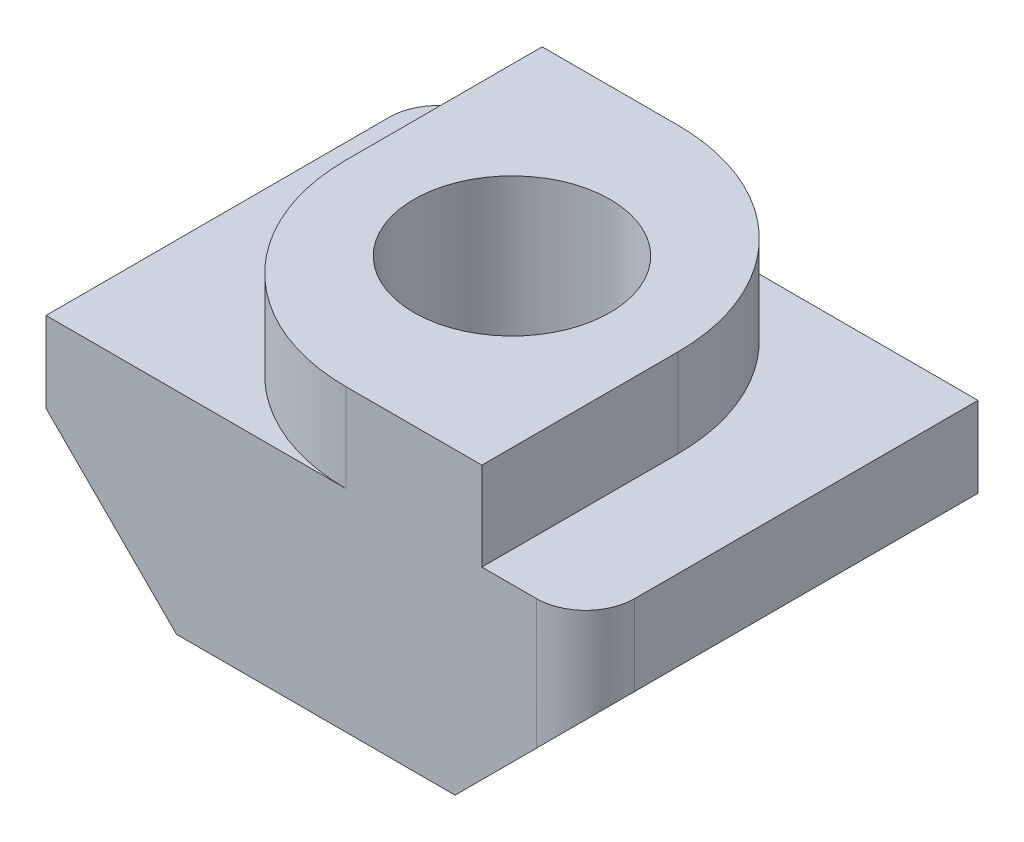
ISO-10303-21;
HEADER;
FILE_DESCRIPTION(('STEP AP214'),'2;1');
FILE_NAME('part.step','',(''),(''),'','','');
FILE_SCHEMA(('AUTOMOTIVE_DESIGN { 1 0 10303 214 1 1 1 1 }'));
ENDSEC;
DATA;
#1=APPLICATION_CONTEXT('core data for automotive mechanical design processes');
#2=APPLICATION_PROTOCOL_DEFINITION('international standard','automotive_design',2000,#1);
#3=PRODUCT_CONTEXT('',#1,'mechanical');
#4=PRODUCT('Part','Part','',(#3));
#5=PRODUCT_RELATED_PRODUCT_CATEGORY('part','',(#4));
#6=PRODUCT_DEFINITION_FORMATION('','',#4);
#7=PRODUCT_DEFINITION_CONTEXT('part definition',#1,'design');
#8=PRODUCT_DEFINITION('design','',#6,#7);
#9=PRODUCT_DEFINITION_SHAPE('','',#8);
#10=(LENGTH_UNIT() NAMED_UNIT(*) SI_UNIT(.MILLI.,.METRE.));
#11=(NAMED_UNIT(*) PLANE_ANGLE_UNIT() SI_UNIT($,.RADIAN.));
#12=(NAMED_UNIT(*) SI_UNIT($,.STERADIAN.) SOLID_ANGLE_UNIT());
#13=UNCERTAINTY_MEASURE_WITH_UNIT(LENGTH_MEASURE(1.E-05),#10,'distance_accuracy_value','');
#14=(GEOMETRIC_REPRESENTATION_CONTEXT(3) GLOBAL_UNCERTAINTY_ASSIGNED_CONTEXT((#13)) GLOBAL_UNIT_ASSIGNED_CONTEXT((#10,
#11,#12)) REPRESENTATION_CONTEXT('',''));
#15=CARTESIAN_POINT('',(0.,0.,0.));
#16=DIRECTION('',(0.,0.,1.));
#17=DIRECTION('',(1.,0.,0.));
#18=AXIS2_PLACEMENT_3D('',#15,#16,#17);
#19=CARTESIAN_POINT('',(0.,4.3,0.));
#20=DIRECTION('',(0.,-1.,0.));
#21=DIRECTION('',(0.,0.,-1.));
#22=AXIS2_PLACEMENT_3D('',#19,#20,#21);
#23=PLANE('',#22);
#24=DIRECTION('',(1.,0.,0.));
#25=VECTOR('',#24,1.);
#26=CARTESIAN_POINT('',(-5.5,4.3,4.));
#27=LINE('',#26,#25);
#28=CARTESIAN_POINT('',(3.385,4.3,4.));
#29=VERTEX_POINT('',#28);
#30=CARTESIAN_POINT('',(4.5,4.3,4.));
#31=VERTEX_POINT('',#30);
#32=EDGE_CURVE('E256',#29,#31,#27,.T.);
#33=ORIENTED_EDGE('',*,*,#32,.T.);
#34=CARTESIAN_POINT('',(4.5,4.3,3.));
#35=DIRECTION('',(0.,-1.,0.));
#36=DIRECTION('',(0.,0.,-1.));
#37=AXIS2_PLACEMENT_3D('',#34,#35,#36);
#38=CIRCLE('',#37,1.);
#39=CARTESIAN_POINT('',(5.5,4.3,3.));
#40=VERTEX_POINT('',#39);
#41=EDGE_CURVE('E204',#31,#40,#38,.F.);
#42=ORIENTED_EDGE('',*,*,#41,.T.);
#43=DIRECTION('',(0.,0.,-1.));
#44=VECTOR('',#43,1.);
#45=CARTESIAN_POINT('',(5.5,4.3,4.));
#46=LINE('',#45,#44);
#47=CARTESIAN_POINT('',(5.5,4.3,-4.));
#48=VERTEX_POINT('',#47);
#49=EDGE_CURVE('E234',#40,#48,#46,.T.);
#50=ORIENTED_EDGE('',*,*,#49,.T.);
#51=DIRECTION('',(-1.,0.,0.));
#52=VECTOR('',#51,1.);
#53=CARTESIAN_POINT('',(-5.5,4.3,-4.));
#54=LINE('',#53,#52);
#55=CARTESIAN_POINT('',(-0.615,4.3,-4.));
#56=VERTEX_POINT('',#55);
#57=EDGE_CURVE('E244',#48,#56,#54,.T.);
#58=ORIENTED_EDGE('',*,*,#57,.T.);
#59=CARTESIAN_POINT('',(-0.615,4.3,0.));
#60=DIRECTION('',(0.,-1.,0.));
#61=DIRECTION('',(0.,0.,-1.));
#62=AXIS2_PLACEMENT_3D('',#59,#60,#61);
#63=CIRCLE('',#62,4.);
#64=CARTESIAN_POINT('',(3.385,4.3,0.));
#65=VERTEX_POINT('',#64);
#66=EDGE_CURVE('E193',#56,#65,#63,.T.);
#67=ORIENTED_EDGE('',*,*,#66,.T.);
#68=DIRECTION('',(0.,0.,-1.));
#69=VECTOR('',#68,1.);
#70=CARTESIAN_POINT('',(3.385,4.3,4.));
#71=LINE('',#70,#69);
#72=EDGE_CURVE('E170',#29,#65,#71,.T.);
#73=ORIENTED_EDGE('',*,*,#72,.F.);
#74=EDGE_LOOP('',(#33,#42,#50,#58,#67,#73));
#75=FACE_BOUND('',#74,.T.);
#76=ADVANCED_FACE('F33',(#75),#23,.F.);
#77=CARTESIAN_POINT('',(-3.385,4.3,-4.));
#78=VERTEX_POINT('',#77);
#79=CARTESIAN_POINT('',(-4.5,4.3,-4.));
#80=VERTEX_POINT('',#79);
#81=EDGE_CURVE('E151',#78,#80,#54,.T.);
#82=ORIENTED_EDGE('',*,*,#81,.T.);
#83=CARTESIAN_POINT('',(-4.5,4.3,-3.));
#84=DIRECTION('',(0.,-1.,0.));
#85=DIRECTION('',(0.,0.,-1.));
#86=AXIS2_PLACEMENT_3D('',#83,#84,#85);
#87=CIRCLE('',#86,1.);
#88=CARTESIAN_POINT('',(-5.5,4.3,-3.));
#89=VERTEX_POINT('',#88);
#90=EDGE_CURVE('E11',#80,#89,#87,.F.);
#91=ORIENTED_EDGE('',*,*,#90,.T.);
#92=DIRECTION('',(0.,0.,1.));
#93=VECTOR('',#92,1.);
#94=CARTESIAN_POINT('',(-5.5,4.3,4.));
#95=LINE('',#94,#93);
#96=CARTESIAN_POINT('',(-5.5,4.3,4.));
#97=VERTEX_POINT('',#96);
#98=EDGE_CURVE('E216',#89,#97,#95,.T.);
#99=ORIENTED_EDGE('',*,*,#98,.T.);
#100=CARTESIAN_POINT('',(0.615,4.3,4.));
#101=VERTEX_POINT('',#100);
#102=EDGE_CURVE('E250',#97,#101,#27,.T.);
#103=ORIENTED_EDGE('',*,*,#102,.T.);
#104=CARTESIAN_POINT('',(0.615,4.3,0.));
#105=DIRECTION('',(0.,-1.,0.));
#106=DIRECTION('',(0.,0.,-1.));
#107=AXIS2_PLACEMENT_3D('',#104,#105,#106);
#108=CIRCLE('',#107,4.);
#109=CARTESIAN_POINT('',(-3.385,4.3,0.));
#110=VERTEX_POINT('',#109);
#111=EDGE_CURVE('E195',#101,#110,#108,.T.);
#112=ORIENTED_EDGE('',*,*,#111,.T.);
#113=DIRECTION('',(0.,0.,1.));
#114=VECTOR('',#113,1.);
#115=CARTESIAN_POINT('',(-3.385,4.3,4.));
#116=LINE('',#115,#114);
#117=EDGE_CURVE('E174',#78,#110,#116,.T.);
#118=ORIENTED_EDGE('',*,*,#117,.F.);
#119=EDGE_LOOP('',(#82,#91,#99,#103,#112,#118));
#120=FACE_BOUND('',#119,.T.);
#121=ADVANCED_FACE('F265',(#120),#23,.F.);
#122=CARTESIAN_POINT('',(0.,0.,0.));
#123=DIRECTION('',(0.,-1.,0.));
#124=DIRECTION('',(0.,0.,-1.));
#125=AXIS2_PLACEMENT_3D('',#122,#123,#124);
#126=PLANE('',#125);
#127=DIRECTION('',(0.,0.,1.));
#128=VECTOR('',#127,1.);
#129=CARTESIAN_POINT('',(2.84000000000001,0.,-4.));
#130=LINE('',#129,#128);
#131=CARTESIAN_POINT('',(2.84000000000001,0.,-4.));
#132=VERTEX_POINT('',#131);
#133=CARTESIAN_POINT('',(2.84000000000001,0.,4.));
#134=VERTEX_POINT('',#133);
#135=EDGE_CURVE('E342',#132,#134,#130,.T.);
#136=ORIENTED_EDGE('',*,*,#135,.T.);
#137=DIRECTION('',(1.,0.,0.));
#138=VECTOR('',#137,1.);
#139=CARTESIAN_POINT('',(-5.5,0.,4.));
#140=LINE('',#139,#138);
#141=CARTESIAN_POINT('',(-2.84000000000001,0.,4.));
#142=VERTEX_POINT('',#141);
#143=EDGE_CURVE('E236',#142,#134,#140,.T.);
#144=ORIENTED_EDGE('',*,*,#143,.F.);
#145=DIRECTION('',(0.,0.,1.));
#146=VECTOR('',#145,1.);
#147=CARTESIAN_POINT('',(-2.84000000000001,0.,-4.));
#148=LINE('',#147,#146);
#149=CARTESIAN_POINT('',(-2.84000000000001,0.,-4.));
#150=VERTEX_POINT('',#149);
#151=EDGE_CURVE('E224',#150,#142,#148,.T.);
#152=ORIENTED_EDGE('',*,*,#151,.F.);
#153=DIRECTION('',(-1.,0.,0.));
#154=VECTOR('',#153,1.);
#155=CARTESIAN_POINT('',(-5.5,0.,-4.));
#156=LINE('',#155,#154);
#157=EDGE_CURVE('E227',#132,#150,#156,.T.);
#158=ORIENTED_EDGE('',*,*,#157,.F.);
#159=EDGE_LOOP('',(#136,#144,#152,#158));
#160=FACE_BOUND('',#159,.T.);
#161=CARTESIAN_POINT('',(0.,0.,0.));
#162=DIRECTION('',(0.,1.,0.));
#163=DIRECTION('',(0.,0.,1.));
#164=AXIS2_PLACEMENT_3D('',#161,#162,#163);
#165=CIRCLE('',#164,2.);
#166=CARTESIAN_POINT('',(0.,0.,2.));
#167=VERTEX_POINT('',#166);
#168=EDGE_CURVE('E223',#167,#167,#165,.T.);
#169=ORIENTED_EDGE('',*,*,#168,.T.);
#170=EDGE_LOOP('',(#169));
#171=FACE_BOUND('',#170,.T.);
#172=ADVANCED_FACE('F298',(#160,#171),#126,.T.);
#173=CARTESIAN_POINT('',(5.5,4.3,4.));
#174=DIRECTION('',(-1.,0.,0.));
#175=DIRECTION('',(0.,0.,1.));
#176=AXIS2_PLACEMENT_3D('',#173,#174,#175);
#177=PLANE('',#176);
#178=ORIENTED_EDGE('',*,*,#49,.F.);
#179=DIRECTION('',(0.,-1.,0.));
#180=VECTOR('',#179,1.);
#181=CARTESIAN_POINT('',(5.5,4.3,3.));
#182=LINE('',#181,#180);
#183=CARTESIAN_POINT('',(5.5,2.66,3.));
#184=VERTEX_POINT('',#183);
#185=EDGE_CURVE('E197',#40,#184,#182,.T.);
#186=ORIENTED_EDGE('',*,*,#185,.T.);
#187=DIRECTION('',(0.,0.,1.));
#188=VECTOR('',#187,1.);
#189=CARTESIAN_POINT('',(5.5,2.66,-4.));
#190=LINE('',#189,#188);
#191=CARTESIAN_POINT('',(5.5,2.66,-4.));
#192=VERTEX_POINT('',#191);
#193=EDGE_CURVE('E333',#192,#184,#190,.T.);
#194=ORIENTED_EDGE('',*,*,#193,.F.);
#195=DIRECTION('',(0.,-1.,0.));
#196=VECTOR('',#195,1.);
#197=CARTESIAN_POINT('',(5.5,4.3,-4.));
#198=LINE('',#197,#196);
#199=EDGE_CURVE('E184',#48,#192,#198,.T.);
#200=ORIENTED_EDGE('',*,*,#199,.F.);
#201=EDGE_LOOP('',(#178,#186,#194,#200));
#202=FACE_BOUND('',#201,.T.);
#203=ADVANCED_FACE('F304',(#202),#177,.F.);
#204=CARTESIAN_POINT('',(-5.5,4.3,-4.));
#205=DIRECTION('',(0.,0.,1.));
#206=DIRECTION('',(1.,0.,0.));
#207=AXIS2_PLACEMENT_3D('',#204,#205,#206);
#208=PLANE('',#207);
#209=DIRECTION('',(-0.707106781186546,0.707106781186549,0.));
#210=VECTOR('',#209,1.);
#211=CARTESIAN_POINT('',(-5.5,2.66,-4.));
#212=LINE('',#211,#210);
#213=CARTESIAN_POINT('',(-4.5,1.66,-4.));
#214=VERTEX_POINT('',#213);
#215=EDGE_CURVE('E229',#150,#214,#212,.T.);
#216=ORIENTED_EDGE('',*,*,#215,.T.);
#217=DIRECTION('',(0.,-1.,0.));
#218=VECTOR('',#217,1.);
#219=CARTESIAN_POINT('',(-4.5,4.3,-4.));
#220=LINE('',#219,#218);
#221=EDGE_CURVE('E41',#214,#80,#220,.F.);
#222=ORIENTED_EDGE('',*,*,#221,.T.);
#223=ORIENTED_EDGE('',*,*,#81,.F.);
#224=DIRECTION('',(0.,-1.,0.));
#225=VECTOR('',#224,1.);
#226=CARTESIAN_POINT('',(-3.385,6.1,-4.));
#227=LINE('',#226,#225);
#228=CARTESIAN_POINT('',(-3.385,6.1,-4.));
#229=VERTEX_POINT('',#228);
#230=EDGE_CURVE('E149',#229,#78,#227,.T.);
#231=ORIENTED_EDGE('',*,*,#230,.F.);
#232=DIRECTION('',(-1.,0.,0.));
#233=VECTOR('',#232,1.);
#234=CARTESIAN_POINT('',(-3.385,6.1,-4.));
#235=LINE('',#234,#233);
#236=CARTESIAN_POINT('',(-0.615,6.1,-4.));
#237=VERTEX_POINT('',#236);
#238=EDGE_CURVE('E134',#237,#229,#235,.T.);
#239=ORIENTED_EDGE('',*,*,#238,.F.);
#240=DIRECTION('',(0.,-1.,0.));
#241=VECTOR('',#240,1.);
#242=CARTESIAN_POINT('',(-0.615,4.3,-4.));
#243=LINE('',#242,#241);
#244=EDGE_CURVE('E181',#237,#56,#243,.T.);
#245=ORIENTED_EDGE('',*,*,#244,.T.);
#246=ORIENTED_EDGE('',*,*,#57,.F.);
#247=ORIENTED_EDGE('',*,*,#199,.T.);
#248=DIRECTION('',(-0.707106781186547,-0.707106781186548,0.));
#249=VECTOR('',#248,1.);
#250=CARTESIAN_POINT('',(5.5,2.66,-4.));
#251=LINE('',#250,#249);
#252=EDGE_CURVE('E335',#192,#132,#251,.T.);
#253=ORIENTED_EDGE('',*,*,#252,.T.);
#254=ORIENTED_EDGE('',*,*,#157,.T.);
#255=EDGE_LOOP('',(#216,#222,#223,#231,#239,#245,#246,#247,#253,#254));
#256=FACE_BOUND('',#255,.T.);
#257=ADVANCED_FACE('F150',(#256),#208,.F.);
#258=CARTESIAN_POINT('',(-5.5,4.3,4.));
#259=DIRECTION('',(1.,0.,0.));
#260=DIRECTION('',(0.,0.,-1.));
#261=AXIS2_PLACEMENT_3D('',#258,#259,#260);
#262=PLANE('',#261);
#263=ORIENTED_EDGE('',*,*,#98,.F.);
#264=DIRECTION('',(0.,-1.,0.));
#265=VECTOR('',#264,1.);
#266=CARTESIAN_POINT('',(-5.5,4.3,-3.));
#267=LINE('',#266,#265);
#268=CARTESIAN_POINT('',(-5.5,2.66,-3.));
#269=VERTEX_POINT('',#268);
#270=EDGE_CURVE('E206',#89,#269,#267,.T.);
#271=ORIENTED_EDGE('',*,*,#270,.T.);
#272=DIRECTION('',(0.,0.,1.));
#273=VECTOR('',#272,1.);
#274=CARTESIAN_POINT('',(-5.5,2.66,-4.));
#275=LINE('',#274,#273);
#276=CARTESIAN_POINT('',(-5.5,2.66,4.));
#277=VERTEX_POINT('',#276);
#278=EDGE_CURVE('E214',#269,#277,#275,.T.);
#279=ORIENTED_EDGE('',*,*,#278,.T.);
#280=DIRECTION('',(0.,-1.,0.));
#281=VECTOR('',#280,1.);
#282=CARTESIAN_POINT('',(-5.5,4.3,4.));
#283=LINE('',#282,#281);
#284=EDGE_CURVE('E248',#97,#277,#283,.T.);
#285=ORIENTED_EDGE('',*,*,#284,.F.);
#286=EDGE_LOOP('',(#263,#271,#279,#285));
#287=FACE_BOUND('',#286,.T.);
#288=ADVANCED_FACE('F212',(#287),#262,.F.);
#289=CARTESIAN_POINT('',(-5.5,4.3,4.));
#290=DIRECTION('',(0.,0.,-1.));
#291=DIRECTION('',(-1.,0.,0.));
#292=AXIS2_PLACEMENT_3D('',#289,#290,#291);
#293=PLANE('',#292);
#294=DIRECTION('',(-0.707106781186547,-0.707106781186548,0.));
#295=VECTOR('',#294,1.);
#296=CARTESIAN_POINT('',(5.5,2.66,4.));
#297=LINE('',#296,#295);
#298=CARTESIAN_POINT('',(4.5,1.66,4.));
#299=VERTEX_POINT('',#298);
#300=EDGE_CURVE('E154',#299,#134,#297,.T.);
#301=ORIENTED_EDGE('',*,*,#300,.F.);
#302=DIRECTION('',(0.,-1.,0.));
#303=VECTOR('',#302,1.);
#304=CARTESIAN_POINT('',(4.5,4.3,4.));
#305=LINE('',#304,#303);
#306=EDGE_CURVE('E202',#299,#31,#305,.F.);
#307=ORIENTED_EDGE('',*,*,#306,.T.);
#308=ORIENTED_EDGE('',*,*,#32,.F.);
#309=DIRECTION('',(0.,-1.,0.));
#310=VECTOR('',#309,1.);
#311=CARTESIAN_POINT('',(3.385,6.1,4.));
#312=LINE('',#311,#310);
#313=CARTESIAN_POINT('',(3.385,6.1,4.));
#314=VERTEX_POINT('',#313);
#315=EDGE_CURVE('E155',#314,#29,#312,.T.);
#316=ORIENTED_EDGE('',*,*,#315,.F.);
#317=DIRECTION('',(1.,0.,0.));
#318=VECTOR('',#317,1.);
#319=CARTESIAN_POINT('',(-3.385,6.1,4.));
#320=LINE('',#319,#318);
#321=CARTESIAN_POINT('',(0.615,6.1,4.));
#322=VERTEX_POINT('',#321);
#323=EDGE_CURVE('E160',#322,#314,#320,.T.);
#324=ORIENTED_EDGE('',*,*,#323,.F.);
#325=DIRECTION('',(0.,-1.,0.));
#326=VECTOR('',#325,1.);
#327=CARTESIAN_POINT('',(0.615,4.3,4.));
#328=LINE('',#327,#326);
#329=EDGE_CURVE('E189',#322,#101,#328,.T.);
#330=ORIENTED_EDGE('',*,*,#329,.T.);
#331=ORIENTED_EDGE('',*,*,#102,.F.);
#332=ORIENTED_EDGE('',*,*,#284,.T.);
#333=DIRECTION('',(-0.707106781186546,0.707106781186549,0.));
#334=VECTOR('',#333,1.);
#335=CARTESIAN_POINT('',(-5.5,2.66,4.));
#336=LINE('',#335,#334);
#337=EDGE_CURVE('E221',#142,#277,#336,.T.);
#338=ORIENTED_EDGE('',*,*,#337,.F.);
#339=ORIENTED_EDGE('',*,*,#143,.T.);
#340=EDGE_LOOP('',(#301,#307,#308,#316,#324,#330,#331,#332,#338,#339));
#341=FACE_BOUND('',#340,.T.);
#342=ADVANCED_FACE('F268',(#341),#293,.F.);
#343=CARTESIAN_POINT('',(0.,4.3,0.));
#344=DIRECTION('',(0.,-1.,0.));
#345=DIRECTION('',(0.,0.,-1.));
#346=AXIS2_PLACEMENT_3D('',#343,#344,#345);
#347=CYLINDRICAL_SURFACE('',#346,2.);
#348=ORIENTED_EDGE('',*,*,#168,.F.);
#349=EDGE_LOOP('',(#348));
#350=FACE_BOUND('',#349,.T.);
#351=CARTESIAN_POINT('',(0.,6.1,0.));
#352=DIRECTION('',(0.,1.,0.));
#353=DIRECTION('',(0.,0.,1.));
#354=AXIS2_PLACEMENT_3D('',#351,#352,#353);
#355=CIRCLE('',#354,2.);
#356=CARTESIAN_POINT('',(0.,6.1,2.));
#357=VERTEX_POINT('',#356);
#358=EDGE_CURVE('E175',#357,#357,#355,.T.);
#359=ORIENTED_EDGE('',*,*,#358,.T.);
#360=EDGE_LOOP('',(#359));
#361=FACE_BOUND('',#360,.T.);
#362=ADVANCED_FACE('F279',(#350,#361),#347,.F.);
#363=CARTESIAN_POINT('',(-5.5,2.66,-4.));
#364=DIRECTION('',(0.707106781186549,0.707106781186546,0.));
#365=DIRECTION('',(-0.707106781186546,0.707106781186549,0.));
#366=AXIS2_PLACEMENT_3D('',#363,#364,#365);
#367=PLANE('',#366);
#368=ORIENTED_EDGE('',*,*,#278,.F.);
#369=CARTESIAN_POINT('',(-4.5,1.66,-3.));
#370=DIRECTION('',(0.707106781186549,0.707106781186546,0.));
#371=DIRECTION('',(0.707106781186546,-0.707106781186549,0.));
#372=AXIS2_PLACEMENT_3D('',#369,#370,#371);
#373=ELLIPSE('',#372,1.4142135623731,1.);
#374=EDGE_CURVE('E55',#269,#214,#373,.F.);
#375=ORIENTED_EDGE('',*,*,#374,.T.);
#376=ORIENTED_EDGE('',*,*,#215,.F.);
#377=ORIENTED_EDGE('',*,*,#151,.T.);
#378=ORIENTED_EDGE('',*,*,#337,.T.);
#379=EDGE_LOOP('',(#368,#375,#376,#377,#378));
#380=FACE_BOUND('',#379,.T.);
#381=ADVANCED_FACE('F219',(#380),#367,.F.);
#382=CARTESIAN_POINT('',(5.5,2.66,-4.));
#383=DIRECTION('',(-0.707106781186549,0.707106781186547,0.));
#384=DIRECTION('',(-0.707106781186547,-0.707106781186549,0.));
#385=AXIS2_PLACEMENT_3D('',#382,#383,#384);
#386=PLANE('',#385);
#387=ORIENTED_EDGE('',*,*,#193,.T.);
#388=CARTESIAN_POINT('',(4.5,1.66,3.));
#389=DIRECTION('',(-0.707106781186549,0.707106781186547,0.));
#390=DIRECTION('',(-0.707106781186547,-0.707106781186549,0.));
#391=AXIS2_PLACEMENT_3D('',#388,#389,#390);
#392=ELLIPSE('',#391,1.4142135623731,1.);
#393=EDGE_CURVE('E200',#184,#299,#392,.F.);
#394=ORIENTED_EDGE('',*,*,#393,.T.);
#395=ORIENTED_EDGE('',*,*,#300,.T.);
#396=ORIENTED_EDGE('',*,*,#135,.F.);
#397=ORIENTED_EDGE('',*,*,#252,.F.);
#398=EDGE_LOOP('',(#387,#394,#395,#396,#397));
#399=FACE_BOUND('',#398,.T.);
#400=ADVANCED_FACE('F282',(#399),#386,.F.);
#401=CARTESIAN_POINT('',(0.,6.1,0.));
#402=DIRECTION('',(0.,-1.,0.));
#403=DIRECTION('',(0.,0.,-1.));
#404=AXIS2_PLACEMENT_3D('',#401,#402,#403);
#405=PLANE('',#404);
#406=DIRECTION('',(0.,0.,-1.));
#407=VECTOR('',#406,1.);
#408=CARTESIAN_POINT('',(3.385,6.1,4.));
#409=LINE('',#408,#407);
#410=CARTESIAN_POINT('',(3.385,6.1,0.));
#411=VERTEX_POINT('',#410);
#412=EDGE_CURVE('E146',#314,#411,#409,.T.);
#413=ORIENTED_EDGE('',*,*,#412,.T.);
#414=CARTESIAN_POINT('',(-0.615,6.1,0.));
#415=DIRECTION('',(0.,-1.,0.));
#416=DIRECTION('',(0.,0.,-1.));
#417=AXIS2_PLACEMENT_3D('',#414,#415,#416);
#418=CIRCLE('',#417,4.);
#419=EDGE_CURVE('E143',#411,#237,#418,.F.);
#420=ORIENTED_EDGE('',*,*,#419,.T.);
#421=ORIENTED_EDGE('',*,*,#238,.T.);
#422=DIRECTION('',(0.,0.,1.));
#423=VECTOR('',#422,1.);
#424=CARTESIAN_POINT('',(-3.385,6.1,4.));
#425=LINE('',#424,#423);
#426=CARTESIAN_POINT('',(-3.385,6.1,0.));
#427=VERTEX_POINT('',#426);
#428=EDGE_CURVE('E140',#229,#427,#425,.T.);
#429=ORIENTED_EDGE('',*,*,#428,.T.);
#430=CARTESIAN_POINT('',(0.615,6.1,0.));
#431=DIRECTION('',(0.,-1.,0.));
#432=DIRECTION('',(0.,0.,-1.));
#433=AXIS2_PLACEMENT_3D('',#430,#431,#432);
#434=CIRCLE('',#433,4.);
#435=EDGE_CURVE('E186',#427,#322,#434,.F.);
#436=ORIENTED_EDGE('',*,*,#435,.T.);
#437=ORIENTED_EDGE('',*,*,#323,.T.);
#438=EDGE_LOOP('',(#413,#420,#421,#429,#436,#437));
#439=FACE_BOUND('',#438,.T.);
#440=ORIENTED_EDGE('',*,*,#358,.F.);
#441=EDGE_LOOP('',(#440));
#442=FACE_BOUND('',#441,.T.);
#443=ADVANCED_FACE('F137',(#439,#442),#405,.F.);
#444=CARTESIAN_POINT('',(3.385,6.1,4.));
#445=DIRECTION('',(-1.,0.,0.));
#446=DIRECTION('',(0.,0.,1.));
#447=AXIS2_PLACEMENT_3D('',#444,#445,#446);
#448=PLANE('',#447);
#449=ORIENTED_EDGE('',*,*,#72,.T.);
#450=DIRECTION('',(0.,-1.,0.));
#451=VECTOR('',#450,1.);
#452=CARTESIAN_POINT('',(3.385,6.1,0.));
#453=LINE('',#452,#451);
#454=EDGE_CURVE('E183',#65,#411,#453,.F.);
#455=ORIENTED_EDGE('',*,*,#454,.T.);
#456=ORIENTED_EDGE('',*,*,#412,.F.);
#457=ORIENTED_EDGE('',*,*,#315,.T.);
#458=EDGE_LOOP('',(#449,#455,#456,#457));
#459=FACE_BOUND('',#458,.T.);
#460=ADVANCED_FACE('F281',(#459),#448,.F.);
#461=CARTESIAN_POINT('',(-3.385,6.1,4.));
#462=DIRECTION('',(1.,0.,0.));
#463=DIRECTION('',(0.,0.,-1.));
#464=AXIS2_PLACEMENT_3D('',#461,#462,#463);
#465=PLANE('',#464);
#466=ORIENTED_EDGE('',*,*,#117,.T.);
#467=DIRECTION('',(0.,-1.,0.));
#468=VECTOR('',#467,1.);
#469=CARTESIAN_POINT('',(-3.385,6.1,0.));
#470=LINE('',#469,#468);
#471=EDGE_CURVE('E159',#110,#427,#470,.F.);
#472=ORIENTED_EDGE('',*,*,#471,.T.);
#473=ORIENTED_EDGE('',*,*,#428,.F.);
#474=ORIENTED_EDGE('',*,*,#230,.T.);
#475=EDGE_LOOP('',(#466,#472,#473,#474));
#476=FACE_BOUND('',#475,.T.);
#477=ADVANCED_FACE('F157',(#476),#465,.F.);
#478=CARTESIAN_POINT('',(-0.615,4.3,0.));
#479=DIRECTION('',(0.,-1.,0.));
#480=DIRECTION('',(0.,0.,-1.));
#481=AXIS2_PLACEMENT_3D('',#478,#479,#480);
#482=CYLINDRICAL_SURFACE('',#481,4.);
#483=ORIENTED_EDGE('',*,*,#419,.F.);
#484=ORIENTED_EDGE('',*,*,#454,.F.);
#485=ORIENTED_EDGE('',*,*,#66,.F.);
#486=ORIENTED_EDGE('',*,*,#244,.F.);
#487=EDGE_LOOP('',(#483,#484,#485,#486));
#488=FACE_BOUND('',#487,.T.);
#489=ADVANCED_FACE('F315',(#488),#482,.T.);
#490=CARTESIAN_POINT('',(0.615,4.3,0.));
#491=DIRECTION('',(0.,-1.,0.));
#492=DIRECTION('',(0.,0.,-1.));
#493=AXIS2_PLACEMENT_3D('',#490,#491,#492);
#494=CYLINDRICAL_SURFACE('',#493,4.);
#495=ORIENTED_EDGE('',*,*,#435,.F.);
#496=ORIENTED_EDGE('',*,*,#471,.F.);
#497=ORIENTED_EDGE('',*,*,#111,.F.);
#498=ORIENTED_EDGE('',*,*,#329,.F.);
#499=EDGE_LOOP('',(#495,#496,#497,#498));
#500=FACE_BOUND('',#499,.T.);
#501=ADVANCED_FACE('F273',(#500),#494,.T.);
#502=CARTESIAN_POINT('',(4.5,4.3,3.));
#503=DIRECTION('',(0.,-1.,0.));
#504=DIRECTION('',(0.,0.,-1.));
#505=AXIS2_PLACEMENT_3D('',#502,#503,#504);
#506=CYLINDRICAL_SURFACE('',#505,1.);
#507=ORIENTED_EDGE('',*,*,#41,.F.);
#508=ORIENTED_EDGE('',*,*,#306,.F.);
#509=ORIENTED_EDGE('',*,*,#393,.F.);
#510=ORIENTED_EDGE('',*,*,#185,.F.);
#511=EDGE_LOOP('',(#507,#508,#509,#510));
#512=FACE_BOUND('',#511,.T.);
#513=ADVANCED_FACE('F320',(#512),#506,.T.);
#514=CARTESIAN_POINT('',(-4.5,4.3,-3.));
#515=DIRECTION('',(0.,-1.,0.));
#516=DIRECTION('',(0.,0.,-1.));
#517=AXIS2_PLACEMENT_3D('',#514,#515,#516);
#518=CYLINDRICAL_SURFACE('',#517,1.);
#519=ORIENTED_EDGE('',*,*,#90,.F.);
#520=ORIENTED_EDGE('',*,*,#221,.F.);
#521=ORIENTED_EDGE('',*,*,#374,.F.);
#522=ORIENTED_EDGE('',*,*,#270,.F.);
#523=EDGE_LOOP('',(#519,#520,#521,#522));
#524=FACE_BOUND('',#523,.T.);
#525=ADVANCED_FACE('F35',(#524),#518,.T.);
#526=CLOSED_SHELL('',(#76,#121,#172,#203,#257,#288,#342,#362,#381,#400,#443,#460,#477,#489,#501,
#513,#525));
#527=MANIFOLD_SOLID_BREP('B2',#526);
#528=ADVANCED_BREP_SHAPE_REPRESENTATION('',(#18,#527),#14);
#529=SHAPE_DEFINITION_REPRESENTATION(#9,#528);
ENDSEC;
END-ISO-10303-21;
